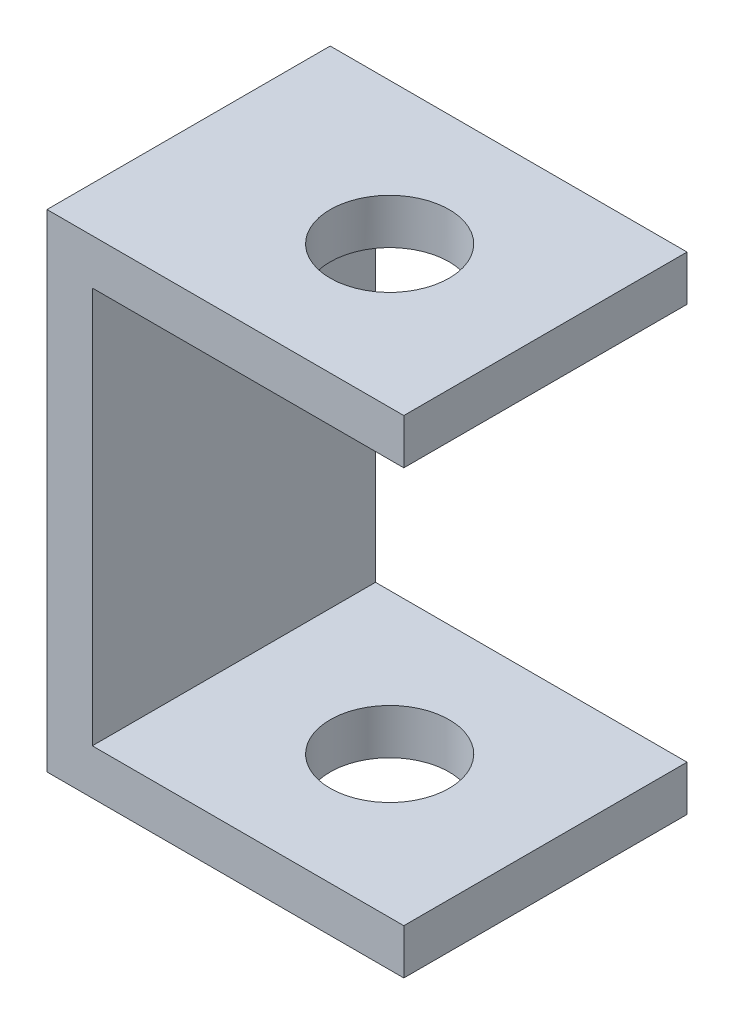
ISO-10303-21;
HEADER;
FILE_DESCRIPTION(('STEP AP214'),'2;1');
FILE_NAME('part.step','',(''),(''),'','','');
FILE_SCHEMA(('AUTOMOTIVE_DESIGN { 1 0 10303 214 1 1 1 1 }'));
ENDSEC;
DATA;
#1=APPLICATION_CONTEXT('core data for automotive mechanical design processes');
#2=APPLICATION_PROTOCOL_DEFINITION('international standard','automotive_design',2000,#1);
#3=PRODUCT_CONTEXT('',#1,'mechanical');
#4=PRODUCT('Part','Part','',(#3));
#5=PRODUCT_RELATED_PRODUCT_CATEGORY('part','',(#4));
#6=PRODUCT_DEFINITION_FORMATION('','',#4);
#7=PRODUCT_DEFINITION_CONTEXT('part definition',#1,'design');
#8=PRODUCT_DEFINITION('design','',#6,#7);
#9=PRODUCT_DEFINITION_SHAPE('','',#8);
#10=(LENGTH_UNIT() NAMED_UNIT(*) SI_UNIT(.MILLI.,.METRE.));
#11=(NAMED_UNIT(*) PLANE_ANGLE_UNIT() SI_UNIT($,.RADIAN.));
#12=(NAMED_UNIT(*) SI_UNIT($,.STERADIAN.) SOLID_ANGLE_UNIT());
#13=UNCERTAINTY_MEASURE_WITH_UNIT(LENGTH_MEASURE(1.E-05),#10,'distance_accuracy_value','');
#14=(GEOMETRIC_REPRESENTATION_CONTEXT(3) GLOBAL_UNCERTAINTY_ASSIGNED_CONTEXT((#13)) GLOBAL_UNIT_ASSIGNED_CONTEXT((#10,
#11,#12)) REPRESENTATION_CONTEXT('',''));
#15=CARTESIAN_POINT('',(0.,0.,0.));
#16=DIRECTION('',(0.,0.,1.));
#17=DIRECTION('',(1.,0.,0.));
#18=AXIS2_PLACEMENT_3D('',#15,#16,#17);
#19=CARTESIAN_POINT('',(0.,86.,50.));
#20=DIRECTION('',(1.,0.,0.));
#21=DIRECTION('',(0.,1.,0.));
#22=AXIS2_PLACEMENT_3D('',#19,#20,#21);
#23=PLANE('',#22);
#24=DIRECTION('',(0.,-1.,0.));
#25=VECTOR('',#24,1.);
#26=CARTESIAN_POINT('',(0.,86.,0.));
#27=LINE('',#26,#25);
#28=CARTESIAN_POINT('',(0.,86.,0.));
#29=VERTEX_POINT('',#28);
#30=CARTESIAN_POINT('',(0.,78.,0.));
#31=VERTEX_POINT('',#30);
#32=EDGE_CURVE('E137',#29,#31,#27,.T.);
#33=ORIENTED_EDGE('',*,*,#32,.F.);
#34=DIRECTION('',(0.,0.,-1.));
#35=VECTOR('',#34,1.);
#36=CARTESIAN_POINT('',(0.,86.,50.));
#37=LINE('',#36,#35);
#38=CARTESIAN_POINT('',(0.,86.,50.));
#39=VERTEX_POINT('',#38);
#40=EDGE_CURVE('E11',#39,#29,#37,.T.);
#41=ORIENTED_EDGE('',*,*,#40,.F.);
#42=DIRECTION('',(0.,-1.,0.));
#43=VECTOR('',#42,1.);
#44=CARTESIAN_POINT('',(0.,86.,50.));
#45=LINE('',#44,#43);
#46=CARTESIAN_POINT('',(0.,78.,50.));
#47=VERTEX_POINT('',#46);
#48=EDGE_CURVE('E158',#39,#47,#45,.T.);
#49=ORIENTED_EDGE('',*,*,#48,.T.);
#50=DIRECTION('',(0.,0.,-1.));
#51=VECTOR('',#50,1.);
#52=CARTESIAN_POINT('',(0.,78.,50.));
#53=LINE('',#52,#51);
#54=EDGE_CURVE('E95',#47,#31,#53,.T.);
#55=ORIENTED_EDGE('',*,*,#54,.T.);
#56=EDGE_LOOP('',(#33,#41,#49,#55));
#57=FACE_BOUND('',#56,.T.);
#58=ADVANCED_FACE('F39',(#57),#23,.T.);
#59=CARTESIAN_POINT('',(-63.,86.,50.));
#60=DIRECTION('',(0.,1.,0.));
#61=DIRECTION('',(0.,0.,1.));
#62=AXIS2_PLACEMENT_3D('',#59,#60,#61);
#63=PLANE('',#62);
#64=CARTESIAN_POINT('',(-27.5,86.,25.));
#65=DIRECTION('',(0.,1.,0.));
#66=DIRECTION('',(0.,0.,1.));
#67=AXIS2_PLACEMENT_3D('',#64,#65,#66);
#68=CIRCLE('',#67,10.5);
#69=CARTESIAN_POINT('',(-27.5,86.,35.5));
#70=VERTEX_POINT('',#69);
#71=EDGE_CURVE('E212',#70,#70,#68,.T.);
#72=ORIENTED_EDGE('',*,*,#71,.F.);
#73=EDGE_LOOP('',(#72));
#74=FACE_BOUND('',#73,.T.);
#75=DIRECTION('',(1.,0.,0.));
#76=VECTOR('',#75,1.);
#77=CARTESIAN_POINT('',(-63.,86.,0.));
#78=LINE('',#77,#76);
#79=CARTESIAN_POINT('',(-63.,86.,0.));
#80=VERTEX_POINT('',#79);
#81=EDGE_CURVE('E156',#80,#29,#78,.T.);
#82=ORIENTED_EDGE('',*,*,#81,.F.);
#83=DIRECTION('',(0.,0.,-1.));
#84=VECTOR('',#83,1.);
#85=CARTESIAN_POINT('',(-63.,86.,50.));
#86=LINE('',#85,#84);
#87=CARTESIAN_POINT('',(-63.,86.,50.));
#88=VERTEX_POINT('',#87);
#89=EDGE_CURVE('E48',#88,#80,#86,.T.);
#90=ORIENTED_EDGE('',*,*,#89,.F.);
#91=DIRECTION('',(1.,0.,0.));
#92=VECTOR('',#91,1.);
#93=CARTESIAN_POINT('',(-63.,86.,50.));
#94=LINE('',#93,#92);
#95=EDGE_CURVE('E127',#88,#39,#94,.T.);
#96=ORIENTED_EDGE('',*,*,#95,.T.);
#97=ORIENTED_EDGE('',*,*,#40,.T.);
#98=EDGE_LOOP('',(#82,#90,#96,#97));
#99=FACE_BOUND('',#98,.T.);
#100=ADVANCED_FACE('F171',(#74,#99),#63,.T.);
#101=CARTESIAN_POINT('',(-63.,0.,50.));
#102=DIRECTION('',(-1.,0.,0.));
#103=DIRECTION('',(0.,0.,1.));
#104=AXIS2_PLACEMENT_3D('',#101,#102,#103);
#105=PLANE('',#104);
#106=DIRECTION('',(0.,1.,0.));
#107=VECTOR('',#106,1.);
#108=CARTESIAN_POINT('',(-63.,0.,0.));
#109=LINE('',#108,#107);
#110=CARTESIAN_POINT('',(-63.,0.,0.));
#111=VERTEX_POINT('',#110);
#112=EDGE_CURVE('E114',#111,#80,#109,.T.);
#113=ORIENTED_EDGE('',*,*,#112,.F.);
#114=DIRECTION('',(0.,0.,-1.));
#115=VECTOR('',#114,1.);
#116=CARTESIAN_POINT('',(-63.,0.,50.));
#117=LINE('',#116,#115);
#118=CARTESIAN_POINT('',(-63.,0.,50.));
#119=VERTEX_POINT('',#118);
#120=EDGE_CURVE('E109',#119,#111,#117,.T.);
#121=ORIENTED_EDGE('',*,*,#120,.F.);
#122=DIRECTION('',(0.,1.,0.));
#123=VECTOR('',#122,1.);
#124=CARTESIAN_POINT('',(-63.,0.,50.));
#125=LINE('',#124,#123);
#126=EDGE_CURVE('E112',#119,#88,#125,.T.);
#127=ORIENTED_EDGE('',*,*,#126,.T.);
#128=ORIENTED_EDGE('',*,*,#89,.T.);
#129=EDGE_LOOP('',(#113,#121,#127,#128));
#130=FACE_BOUND('',#129,.T.);
#131=ADVANCED_FACE('F111',(#130),#105,.T.);
#132=CARTESIAN_POINT('',(0.,0.,50.));
#133=DIRECTION('',(0.,-1.,0.));
#134=DIRECTION('',(1.,0.,0.));
#135=AXIS2_PLACEMENT_3D('',#132,#133,#134);
#136=PLANE('',#135);
#137=CARTESIAN_POINT('',(-27.5,0.,25.));
#138=DIRECTION('',(0.,1.,0.));
#139=DIRECTION('',(0.,0.,1.));
#140=AXIS2_PLACEMENT_3D('',#137,#138,#139);
#141=CIRCLE('',#140,10.5);
#142=CARTESIAN_POINT('',(-27.5,0.,35.5));
#143=VERTEX_POINT('',#142);
#144=EDGE_CURVE('E208',#143,#143,#141,.T.);
#145=ORIENTED_EDGE('',*,*,#144,.T.);
#146=EDGE_LOOP('',(#145));
#147=FACE_BOUND('',#146,.T.);
#148=DIRECTION('',(-1.,0.,0.));
#149=VECTOR('',#148,1.);
#150=CARTESIAN_POINT('',(0.,0.,0.));
#151=LINE('',#150,#149);
#152=CARTESIAN_POINT('',(0.,0.,0.));
#153=VERTEX_POINT('',#152);
#154=EDGE_CURVE('E153',#153,#111,#151,.T.);
#155=ORIENTED_EDGE('',*,*,#154,.F.);
#156=DIRECTION('',(0.,0.,-1.));
#157=VECTOR('',#156,1.);
#158=CARTESIAN_POINT('',(0.,0.,50.));
#159=LINE('',#158,#157);
#160=CARTESIAN_POINT('',(0.,0.,50.));
#161=VERTEX_POINT('',#160);
#162=EDGE_CURVE('E119',#161,#153,#159,.T.);
#163=ORIENTED_EDGE('',*,*,#162,.F.);
#164=DIRECTION('',(-1.,0.,0.));
#165=VECTOR('',#164,1.);
#166=CARTESIAN_POINT('',(0.,0.,50.));
#167=LINE('',#166,#165);
#168=EDGE_CURVE('E125',#161,#119,#167,.T.);
#169=ORIENTED_EDGE('',*,*,#168,.T.);
#170=ORIENTED_EDGE('',*,*,#120,.T.);
#171=EDGE_LOOP('',(#155,#163,#169,#170));
#172=FACE_BOUND('',#171,.T.);
#173=ADVANCED_FACE('F129',(#147,#172),#136,.T.);
#174=CARTESIAN_POINT('',(0.,8.,50.));
#175=DIRECTION('',(1.,0.,0.));
#176=DIRECTION('',(0.,1.,0.));
#177=AXIS2_PLACEMENT_3D('',#174,#175,#176);
#178=PLANE('',#177);
#179=DIRECTION('',(0.,-1.,0.));
#180=VECTOR('',#179,1.);
#181=CARTESIAN_POINT('',(0.,8.,0.));
#182=LINE('',#181,#180);
#183=CARTESIAN_POINT('',(0.,8.,0.));
#184=VERTEX_POINT('',#183);
#185=EDGE_CURVE('E150',#184,#153,#182,.T.);
#186=ORIENTED_EDGE('',*,*,#185,.F.);
#187=DIRECTION('',(0.,0.,-1.));
#188=VECTOR('',#187,1.);
#189=CARTESIAN_POINT('',(0.,8.,50.));
#190=LINE('',#189,#188);
#191=CARTESIAN_POINT('',(0.,8.,50.));
#192=VERTEX_POINT('',#191);
#193=EDGE_CURVE('E162',#192,#184,#190,.T.);
#194=ORIENTED_EDGE('',*,*,#193,.F.);
#195=DIRECTION('',(0.,-1.,0.));
#196=VECTOR('',#195,1.);
#197=CARTESIAN_POINT('',(0.,8.,50.));
#198=LINE('',#197,#196);
#199=EDGE_CURVE('E130',#192,#161,#198,.T.);
#200=ORIENTED_EDGE('',*,*,#199,.T.);
#201=ORIENTED_EDGE('',*,*,#162,.T.);
#202=EDGE_LOOP('',(#186,#194,#200,#201));
#203=FACE_BOUND('',#202,.T.);
#204=ADVANCED_FACE('F187',(#203),#178,.T.);
#205=CARTESIAN_POINT('',(-55.,8.,50.));
#206=DIRECTION('',(0.,1.,0.));
#207=DIRECTION('',(0.,0.,1.));
#208=AXIS2_PLACEMENT_3D('',#205,#206,#207);
#209=PLANE('',#208);
#210=CARTESIAN_POINT('',(-27.5,8.,25.));
#211=DIRECTION('',(0.,1.,0.));
#212=DIRECTION('',(0.,0.,1.));
#213=AXIS2_PLACEMENT_3D('',#210,#211,#212);
#214=CIRCLE('',#213,10.5);
#215=CARTESIAN_POINT('',(-27.5,8.,35.5));
#216=VERTEX_POINT('',#215);
#217=EDGE_CURVE('E141',#216,#216,#214,.T.);
#218=ORIENTED_EDGE('',*,*,#217,.F.);
#219=EDGE_LOOP('',(#218));
#220=FACE_BOUND('',#219,.T.);
#221=DIRECTION('',(1.,0.,0.));
#222=VECTOR('',#221,1.);
#223=CARTESIAN_POINT('',(-55.,8.,0.));
#224=LINE('',#223,#222);
#225=CARTESIAN_POINT('',(-55.,8.,0.));
#226=VERTEX_POINT('',#225);
#227=EDGE_CURVE('E147',#226,#184,#224,.T.);
#228=ORIENTED_EDGE('',*,*,#227,.F.);
#229=DIRECTION('',(0.,0.,-1.));
#230=VECTOR('',#229,1.);
#231=CARTESIAN_POINT('',(-55.,8.,50.));
#232=LINE('',#231,#230);
#233=CARTESIAN_POINT('',(-55.,8.,50.));
#234=VERTEX_POINT('',#233);
#235=EDGE_CURVE('E164',#234,#226,#232,.T.);
#236=ORIENTED_EDGE('',*,*,#235,.F.);
#237=DIRECTION('',(1.,0.,0.));
#238=VECTOR('',#237,1.);
#239=CARTESIAN_POINT('',(-55.,8.,50.));
#240=LINE('',#239,#238);
#241=EDGE_CURVE('E132',#234,#192,#240,.T.);
#242=ORIENTED_EDGE('',*,*,#241,.T.);
#243=ORIENTED_EDGE('',*,*,#193,.T.);
#244=EDGE_LOOP('',(#228,#236,#242,#243));
#245=FACE_BOUND('',#244,.T.);
#246=ADVANCED_FACE('F191',(#220,#245),#209,.T.);
#247=CARTESIAN_POINT('',(-55.,78.,50.));
#248=DIRECTION('',(1.,0.,0.));
#249=DIRECTION('',(0.,0.,-1.));
#250=AXIS2_PLACEMENT_3D('',#247,#248,#249);
#251=PLANE('',#250);
#252=DIRECTION('',(0.,-1.,0.));
#253=VECTOR('',#252,1.);
#254=CARTESIAN_POINT('',(-55.,78.,0.));
#255=LINE('',#254,#253);
#256=CARTESIAN_POINT('',(-55.,78.,0.));
#257=VERTEX_POINT('',#256);
#258=EDGE_CURVE('E144',#257,#226,#255,.T.);
#259=ORIENTED_EDGE('',*,*,#258,.F.);
#260=DIRECTION('',(0.,0.,-1.));
#261=VECTOR('',#260,1.);
#262=CARTESIAN_POINT('',(-55.,78.,50.));
#263=LINE('',#262,#261);
#264=CARTESIAN_POINT('',(-55.,78.,50.));
#265=VERTEX_POINT('',#264);
#266=EDGE_CURVE('E166',#265,#257,#263,.T.);
#267=ORIENTED_EDGE('',*,*,#266,.F.);
#268=DIRECTION('',(0.,-1.,0.));
#269=VECTOR('',#268,1.);
#270=CARTESIAN_POINT('',(-55.,78.,50.));
#271=LINE('',#270,#269);
#272=EDGE_CURVE('E221',#265,#234,#271,.T.);
#273=ORIENTED_EDGE('',*,*,#272,.T.);
#274=ORIENTED_EDGE('',*,*,#235,.T.);
#275=EDGE_LOOP('',(#259,#267,#273,#274));
#276=FACE_BOUND('',#275,.T.);
#277=ADVANCED_FACE('F195',(#276),#251,.T.);
#278=CARTESIAN_POINT('',(0.,78.,50.));
#279=DIRECTION('',(0.,-1.,0.));
#280=DIRECTION('',(0.,0.,-1.));
#281=AXIS2_PLACEMENT_3D('',#278,#279,#280);
#282=PLANE('',#281);
#283=CARTESIAN_POINT('',(-27.5,78.,25.));
#284=DIRECTION('',(0.,-1.,0.));
#285=DIRECTION('',(0.,0.,-1.));
#286=AXIS2_PLACEMENT_3D('',#283,#284,#285);
#287=CIRCLE('',#286,10.5);
#288=CARTESIAN_POINT('',(-27.5,78.,14.5));
#289=VERTEX_POINT('',#288);
#290=EDGE_CURVE('E42',#289,#289,#287,.T.);
#291=ORIENTED_EDGE('',*,*,#290,.F.);
#292=EDGE_LOOP('',(#291));
#293=FACE_BOUND('',#292,.T.);
#294=DIRECTION('',(-1.,0.,0.));
#295=VECTOR('',#294,1.);
#296=CARTESIAN_POINT('',(0.,78.,0.));
#297=LINE('',#296,#295);
#298=EDGE_CURVE('E140',#31,#257,#297,.T.);
#299=ORIENTED_EDGE('',*,*,#298,.F.);
#300=ORIENTED_EDGE('',*,*,#54,.F.);
#301=DIRECTION('',(-1.,0.,0.));
#302=VECTOR('',#301,1.);
#303=CARTESIAN_POINT('',(0.,78.,50.));
#304=LINE('',#303,#302);
#305=EDGE_CURVE('E219',#47,#265,#304,.T.);
#306=ORIENTED_EDGE('',*,*,#305,.T.);
#307=ORIENTED_EDGE('',*,*,#266,.T.);
#308=EDGE_LOOP('',(#299,#300,#306,#307));
#309=FACE_BOUND('',#308,.T.);
#310=ADVANCED_FACE('F167',(#293,#309),#282,.T.);
#311=CARTESIAN_POINT('',(0.,0.,50.));
#312=DIRECTION('',(0.,0.,-1.));
#313=DIRECTION('',(-1.,0.,0.));
#314=AXIS2_PLACEMENT_3D('',#311,#312,#313);
#315=PLANE('',#314);
#316=ORIENTED_EDGE('',*,*,#48,.F.);
#317=ORIENTED_EDGE('',*,*,#95,.F.);
#318=ORIENTED_EDGE('',*,*,#126,.F.);
#319=ORIENTED_EDGE('',*,*,#168,.F.);
#320=ORIENTED_EDGE('',*,*,#199,.F.);
#321=ORIENTED_EDGE('',*,*,#241,.F.);
#322=ORIENTED_EDGE('',*,*,#272,.F.);
#323=ORIENTED_EDGE('',*,*,#305,.F.);
#324=EDGE_LOOP('',(#316,#317,#318,#319,#320,#321,#322,#323));
#325=FACE_BOUND('',#324,.T.);
#326=ADVANCED_FACE('F123',(#325),#315,.F.);
#327=CARTESIAN_POINT('',(0.,0.,0.));
#328=DIRECTION('',(0.,0.,-1.));
#329=DIRECTION('',(-1.,0.,0.));
#330=AXIS2_PLACEMENT_3D('',#327,#328,#329);
#331=PLANE('',#330);
#332=ORIENTED_EDGE('',*,*,#32,.T.);
#333=ORIENTED_EDGE('',*,*,#298,.T.);
#334=ORIENTED_EDGE('',*,*,#258,.T.);
#335=ORIENTED_EDGE('',*,*,#227,.T.);
#336=ORIENTED_EDGE('',*,*,#185,.T.);
#337=ORIENTED_EDGE('',*,*,#154,.T.);
#338=ORIENTED_EDGE('',*,*,#112,.T.);
#339=ORIENTED_EDGE('',*,*,#81,.T.);
#340=EDGE_LOOP('',(#332,#333,#334,#335,#336,#337,#338,#339));
#341=FACE_BOUND('',#340,.T.);
#342=ADVANCED_FACE('F170',(#341),#331,.T.);
#343=CARTESIAN_POINT('',(-27.5,0.,25.));
#344=DIRECTION('',(0.,1.,0.));
#345=DIRECTION('',(0.,0.,1.));
#346=AXIS2_PLACEMENT_3D('',#343,#344,#345);
#347=CYLINDRICAL_SURFACE('',#346,10.5);
#348=ORIENTED_EDGE('',*,*,#290,.T.);
#349=EDGE_LOOP('',(#348));
#350=FACE_BOUND('',#349,.T.);
#351=ORIENTED_EDGE('',*,*,#71,.T.);
#352=EDGE_LOOP('',(#351));
#353=FACE_BOUND('',#352,.T.);
#354=ADVANCED_FACE('F230',(#350,#353),#347,.F.);
#355=ORIENTED_EDGE('',*,*,#217,.T.);
#356=EDGE_LOOP('',(#355));
#357=FACE_BOUND('',#356,.T.);
#358=ORIENTED_EDGE('',*,*,#144,.F.);
#359=EDGE_LOOP('',(#358));
#360=FACE_BOUND('',#359,.T.);
#361=ADVANCED_FACE('F231',(#357,#360),#347,.F.);
#362=CLOSED_SHELL('',(#58,#100,#131,#173,#204,#246,#277,#310,#326,#342,#354,#361));
#363=MANIFOLD_SOLID_BREP('B2',#362);
#364=ADVANCED_BREP_SHAPE_REPRESENTATION('',(#18,#363),#14);
#365=SHAPE_DEFINITION_REPRESENTATION(#9,#364);
ENDSEC;
END-ISO-10303-21;
